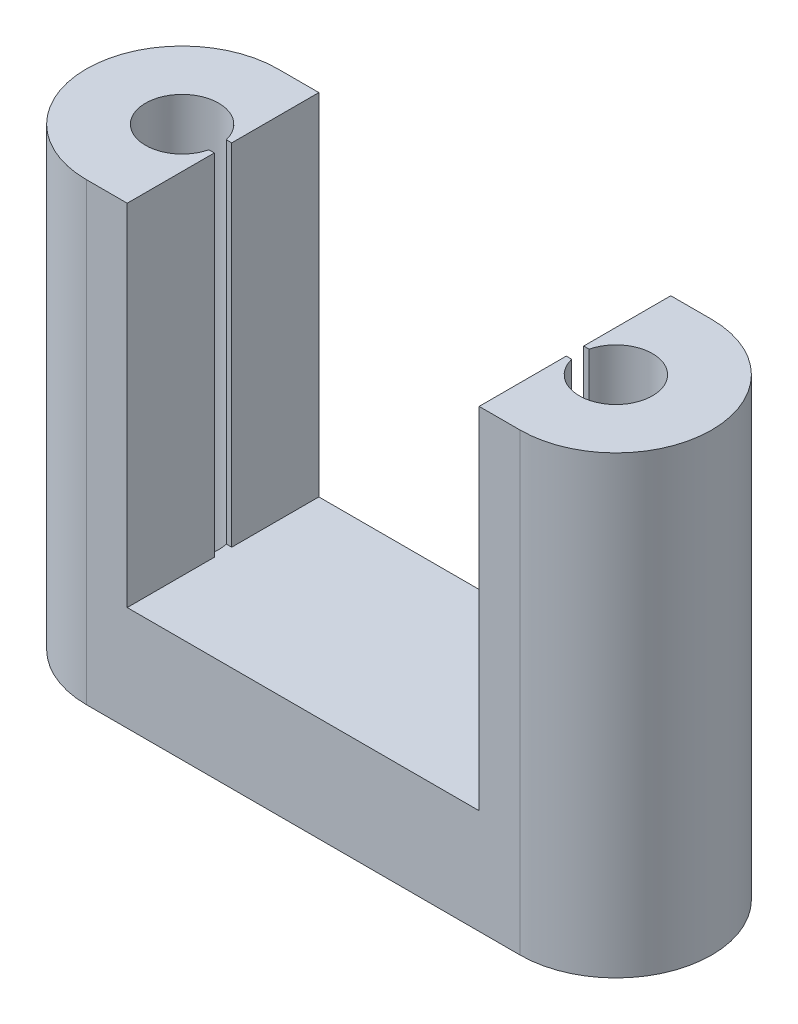
ISO-10303-21;
HEADER;
FILE_DESCRIPTION(('STEP AP214'),'2;1');
FILE_NAME('part.step','',(''),(''),'','','');
FILE_SCHEMA(('AUTOMOTIVE_DESIGN { 1 0 10303 214 1 1 1 1 }'));
ENDSEC;
DATA;
#1=APPLICATION_CONTEXT('core data for automotive mechanical design processes');
#2=APPLICATION_PROTOCOL_DEFINITION('international standard','automotive_design',2000,#1);
#3=PRODUCT_CONTEXT('',#1,'mechanical');
#4=PRODUCT('Part','Part','',(#3));
#5=PRODUCT_RELATED_PRODUCT_CATEGORY('part','',(#4));
#6=PRODUCT_DEFINITION_FORMATION('','',#4);
#7=PRODUCT_DEFINITION_CONTEXT('part definition',#1,'design');
#8=PRODUCT_DEFINITION('design','',#6,#7);
#9=PRODUCT_DEFINITION_SHAPE('','',#8);
#10=(LENGTH_UNIT() NAMED_UNIT(*) SI_UNIT(.MILLI.,.METRE.));
#11=(NAMED_UNIT(*) PLANE_ANGLE_UNIT() SI_UNIT($,.RADIAN.));
#12=(NAMED_UNIT(*) SI_UNIT($,.STERADIAN.) SOLID_ANGLE_UNIT());
#13=UNCERTAINTY_MEASURE_WITH_UNIT(LENGTH_MEASURE(1.E-05),#10,'distance_accuracy_value','');
#14=(GEOMETRIC_REPRESENTATION_CONTEXT(3) GLOBAL_UNCERTAINTY_ASSIGNED_CONTEXT((#13)) GLOBAL_UNIT_ASSIGNED_CONTEXT((#10,
#11,#12)) REPRESENTATION_CONTEXT('',''));
#15=CARTESIAN_POINT('',(0.,0.,0.));
#16=DIRECTION('',(0.,0.,1.));
#17=DIRECTION('',(1.,0.,0.));
#18=AXIS2_PLACEMENT_3D('',#15,#16,#17);
#19=CARTESIAN_POINT('',(0.,6.,0.));
#20=DIRECTION('',(0.,1.,0.));
#21=DIRECTION('',(0.,0.,1.));
#22=AXIS2_PLACEMENT_3D('',#19,#20,#21);
#23=PLANE('',#22);
#24=DIRECTION('',(-1.,0.,0.));
#25=VECTOR('',#24,1.);
#26=CARTESIAN_POINT('',(2.35,6.,0.5));
#27=LINE('',#26,#25);
#28=CARTESIAN_POINT('',(2.35,6.,0.5));
#29=VERTEX_POINT('',#28);
#30=CARTESIAN_POINT('',(2.03960780543711,6.,0.5));
#31=VERTEX_POINT('',#30);
#32=EDGE_CURVE('E191',#29,#31,#27,.T.);
#33=ORIENTED_EDGE('',*,*,#32,.F.);
#34=DIRECTION('',(0.,0.,-1.));
#35=VECTOR('',#34,1.);
#36=CARTESIAN_POINT('',(2.35,6.,0.5));
#37=LINE('',#36,#35);
#38=CARTESIAN_POINT('',(2.35,6.,5.5));
#39=VERTEX_POINT('',#38);
#40=EDGE_CURVE('E189',#39,#29,#37,.T.);
#41=ORIENTED_EDGE('',*,*,#40,.F.);
#42=DIRECTION('',(1.,0.,0.));
#43=VECTOR('',#42,1.);
#44=CARTESIAN_POINT('',(0.,6.,5.5));
#45=LINE('',#44,#43);
#46=CARTESIAN_POINT('',(22.55,6.,5.5));
#47=VERTEX_POINT('',#46);
#48=EDGE_CURVE('E264',#39,#47,#45,.T.);
#49=ORIENTED_EDGE('',*,*,#48,.T.);
#50=DIRECTION('',(0.,0.,1.));
#51=VECTOR('',#50,1.);
#52=CARTESIAN_POINT('',(22.55,6.,0.5));
#53=LINE('',#52,#51);
#54=CARTESIAN_POINT('',(22.55,6.,0.5));
#55=VERTEX_POINT('',#54);
#56=EDGE_CURVE('E56',#55,#47,#53,.T.);
#57=ORIENTED_EDGE('',*,*,#56,.F.);
#58=DIRECTION('',(-1.,0.,0.));
#59=VECTOR('',#58,1.);
#60=CARTESIAN_POINT('',(22.8603921945629,6.,0.5));
#61=LINE('',#60,#59);
#62=CARTESIAN_POINT('',(22.8603921945629,6.,0.5));
#63=VERTEX_POINT('',#62);
#64=EDGE_CURVE('E232',#63,#55,#61,.T.);
#65=ORIENTED_EDGE('',*,*,#64,.F.);
#66=CARTESIAN_POINT('',(24.9,6.,0.));
#67=DIRECTION('',(0.,1.,0.));
#68=DIRECTION('',(0.,0.,1.));
#69=AXIS2_PLACEMENT_3D('',#66,#67,#68);
#70=CIRCLE('',#69,2.1);
#71=CARTESIAN_POINT('',(22.8603921945629,6.,-0.499999999999996));
#72=VERTEX_POINT('',#71);
#73=EDGE_CURVE('E253',#72,#63,#70,.T.);
#74=ORIENTED_EDGE('',*,*,#73,.F.);
#75=DIRECTION('',(1.,0.,0.));
#76=VECTOR('',#75,1.);
#77=CARTESIAN_POINT('',(22.8603921945629,6.,-0.499999999999996));
#78=LINE('',#77,#76);
#79=CARTESIAN_POINT('',(22.55,6.,-0.499999999999996));
#80=VERTEX_POINT('',#79);
#81=EDGE_CURVE('E229',#80,#72,#78,.T.);
#82=ORIENTED_EDGE('',*,*,#81,.F.);
#83=DIRECTION('',(0.,0.,1.));
#84=VECTOR('',#83,1.);
#85=CARTESIAN_POINT('',(22.55,6.,-5.5));
#86=LINE('',#85,#84);
#87=CARTESIAN_POINT('',(22.55,6.,-5.5));
#88=VERTEX_POINT('',#87);
#89=EDGE_CURVE('E206',#88,#80,#86,.T.);
#90=ORIENTED_EDGE('',*,*,#89,.F.);
#91=DIRECTION('',(-1.,0.,0.));
#92=VECTOR('',#91,1.);
#93=CARTESIAN_POINT('',(0.,6.,-5.5));
#94=LINE('',#93,#92);
#95=CARTESIAN_POINT('',(2.35,6.,-5.5));
#96=VERTEX_POINT('',#95);
#97=EDGE_CURVE('E161',#88,#96,#94,.T.);
#98=ORIENTED_EDGE('',*,*,#97,.T.);
#99=DIRECTION('',(0.,0.,-1.));
#100=VECTOR('',#99,1.);
#101=CARTESIAN_POINT('',(2.35,6.,-5.5));
#102=LINE('',#101,#100);
#103=CARTESIAN_POINT('',(2.35,6.,-0.499999999999996));
#104=VERTEX_POINT('',#103);
#105=EDGE_CURVE('E173',#104,#96,#102,.T.);
#106=ORIENTED_EDGE('',*,*,#105,.F.);
#107=DIRECTION('',(1.,0.,0.));
#108=VECTOR('',#107,1.);
#109=CARTESIAN_POINT('',(2.35,6.,-0.499999999999996));
#110=LINE('',#109,#108);
#111=CARTESIAN_POINT('',(2.03960780543712,6.,-0.499999999999996));
#112=VERTEX_POINT('',#111);
#113=EDGE_CURVE('E175',#112,#104,#110,.T.);
#114=ORIENTED_EDGE('',*,*,#113,.F.);
#115=CARTESIAN_POINT('',(0.,6.,0.));
#116=DIRECTION('',(0.,1.,0.));
#117=DIRECTION('',(0.,0.,1.));
#118=AXIS2_PLACEMENT_3D('',#115,#116,#117);
#119=CIRCLE('',#118,2.1);
#120=EDGE_CURVE('E259',#31,#112,#119,.T.);
#121=ORIENTED_EDGE('',*,*,#120,.F.);
#122=EDGE_LOOP('',(#33,#41,#49,#57,#65,#74,#82,#90,#98,#106,#114,#121));
#123=FACE_BOUND('',#122,.T.);
#124=ADVANCED_FACE('F33',(#123),#23,.T.);
#125=CARTESIAN_POINT('',(0.,0.,0.));
#126=DIRECTION('',(0.,1.,0.));
#127=DIRECTION('',(0.,0.,1.));
#128=AXIS2_PLACEMENT_3D('',#125,#126,#127);
#129=PLANE('',#128);
#130=CARTESIAN_POINT('',(0.,0.,0.));
#131=DIRECTION('',(0.,1.,0.));
#132=DIRECTION('',(0.,0.,1.));
#133=AXIS2_PLACEMENT_3D('',#130,#131,#132);
#134=CIRCLE('',#133,5.5);
#135=CARTESIAN_POINT('',(0.,0.,-5.5));
#136=VERTEX_POINT('',#135);
#137=CARTESIAN_POINT('',(0.,0.,5.5));
#138=VERTEX_POINT('',#137);
#139=EDGE_CURVE('E261',#136,#138,#134,.T.);
#140=ORIENTED_EDGE('',*,*,#139,.F.);
#141=DIRECTION('',(-1.,0.,0.));
#142=VECTOR('',#141,1.);
#143=CARTESIAN_POINT('',(0.,0.,-5.5));
#144=LINE('',#143,#142);
#145=CARTESIAN_POINT('',(24.9,0.,-5.5));
#146=VERTEX_POINT('',#145);
#147=EDGE_CURVE('E156',#146,#136,#144,.T.);
#148=ORIENTED_EDGE('',*,*,#147,.F.);
#149=CARTESIAN_POINT('',(24.9,0.,0.));
#150=DIRECTION('',(0.,1.,0.));
#151=DIRECTION('',(0.,0.,1.));
#152=AXIS2_PLACEMENT_3D('',#149,#150,#151);
#153=CIRCLE('',#152,5.5);
#154=CARTESIAN_POINT('',(24.9,0.,5.5));
#155=VERTEX_POINT('',#154);
#156=EDGE_CURVE('E271',#155,#146,#153,.T.);
#157=ORIENTED_EDGE('',*,*,#156,.F.);
#158=DIRECTION('',(1.,0.,0.));
#159=VECTOR('',#158,1.);
#160=CARTESIAN_POINT('',(0.,0.,5.5));
#161=LINE('',#160,#159);
#162=EDGE_CURVE('E269',#138,#155,#161,.T.);
#163=ORIENTED_EDGE('',*,*,#162,.F.);
#164=EDGE_LOOP('',(#140,#148,#157,#163));
#165=FACE_BOUND('',#164,.T.);
#166=CARTESIAN_POINT('',(0.,0.,0.));
#167=DIRECTION('',(0.,1.,0.));
#168=DIRECTION('',(0.,0.,1.));
#169=AXIS2_PLACEMENT_3D('',#166,#167,#168);
#170=CIRCLE('',#169,2.1);
#171=CARTESIAN_POINT('',(0.,0.,2.1));
#172=VERTEX_POINT('',#171);
#173=EDGE_CURVE('E256',#172,#172,#170,.T.);
#174=ORIENTED_EDGE('',*,*,#173,.T.);
#175=EDGE_LOOP('',(#174));
#176=FACE_BOUND('',#175,.T.);
#177=CARTESIAN_POINT('',(24.9,0.,0.));
#178=DIRECTION('',(0.,1.,0.));
#179=DIRECTION('',(0.,0.,1.));
#180=AXIS2_PLACEMENT_3D('',#177,#178,#179);
#181=CIRCLE('',#180,2.1);
#182=CARTESIAN_POINT('',(24.9,0.,2.1));
#183=VERTEX_POINT('',#182);
#184=EDGE_CURVE('E252',#183,#183,#181,.T.);
#185=ORIENTED_EDGE('',*,*,#184,.T.);
#186=EDGE_LOOP('',(#185));
#187=FACE_BOUND('',#186,.T.);
#188=ADVANCED_FACE('F282',(#165,#176,#187),#129,.F.);
#189=CARTESIAN_POINT('',(0.,6.,0.));
#190=DIRECTION('',(0.,-1.,0.));
#191=DIRECTION('',(0.,0.,-1.));
#192=AXIS2_PLACEMENT_3D('',#189,#190,#191);
#193=CYLINDRICAL_SURFACE('',#192,5.5);
#194=ORIENTED_EDGE('',*,*,#139,.T.);
#195=DIRECTION('',(0.,-1.,0.));
#196=VECTOR('',#195,1.);
#197=CARTESIAN_POINT('',(0.,6.,5.5));
#198=LINE('',#197,#196);
#199=CARTESIAN_POINT('',(0.,26.1,5.5));
#200=VERTEX_POINT('',#199);
#201=EDGE_CURVE('E11',#200,#138,#198,.T.);
#202=ORIENTED_EDGE('',*,*,#201,.F.);
#203=CARTESIAN_POINT('',(0.,26.1,0.));
#204=DIRECTION('',(0.,1.,0.));
#205=DIRECTION('',(0.,0.,1.));
#206=AXIS2_PLACEMENT_3D('',#203,#204,#205);
#207=CIRCLE('',#206,5.5);
#208=CARTESIAN_POINT('',(0.,26.1,-5.5));
#209=VERTEX_POINT('',#208);
#210=EDGE_CURVE('E164',#209,#200,#207,.T.);
#211=ORIENTED_EDGE('',*,*,#210,.F.);
#212=DIRECTION('',(0.,-1.,0.));
#213=VECTOR('',#212,1.);
#214=CARTESIAN_POINT('',(0.,6.,-5.5));
#215=LINE('',#214,#213);
#216=EDGE_CURVE('E148',#209,#136,#215,.T.);
#217=ORIENTED_EDGE('',*,*,#216,.T.);
#218=EDGE_LOOP('',(#194,#202,#211,#217));
#219=FACE_BOUND('',#218,.T.);
#220=ADVANCED_FACE('F35',(#219),#193,.T.);
#221=CARTESIAN_POINT('',(0.,6.,5.5));
#222=DIRECTION('',(0.,0.,-1.));
#223=DIRECTION('',(-1.,0.,0.));
#224=AXIS2_PLACEMENT_3D('',#221,#222,#223);
#225=PLANE('',#224);
#226=ORIENTED_EDGE('',*,*,#162,.T.);
#227=DIRECTION('',(0.,-1.,0.));
#228=VECTOR('',#227,1.);
#229=CARTESIAN_POINT('',(24.9,6.,5.5));
#230=LINE('',#229,#228);
#231=CARTESIAN_POINT('',(24.9,26.1,5.5));
#232=VERTEX_POINT('',#231);
#233=EDGE_CURVE('E41',#232,#155,#230,.T.);
#234=ORIENTED_EDGE('',*,*,#233,.F.);
#235=DIRECTION('',(1.,0.,0.));
#236=VECTOR('',#235,1.);
#237=CARTESIAN_POINT('',(22.55,26.1,5.5));
#238=LINE('',#237,#236);
#239=CARTESIAN_POINT('',(22.55,26.1,5.5));
#240=VERTEX_POINT('',#239);
#241=EDGE_CURVE('E220',#240,#232,#238,.T.);
#242=ORIENTED_EDGE('',*,*,#241,.F.);
#243=DIRECTION('',(0.,-1.,0.));
#244=VECTOR('',#243,1.);
#245=CARTESIAN_POINT('',(22.55,26.1,5.5));
#246=LINE('',#245,#244);
#247=EDGE_CURVE('E226',#240,#47,#246,.T.);
#248=ORIENTED_EDGE('',*,*,#247,.T.);
#249=ORIENTED_EDGE('',*,*,#48,.F.);
#250=DIRECTION('',(0.,-1.,0.));
#251=VECTOR('',#250,1.);
#252=CARTESIAN_POINT('',(2.35,26.1,5.5));
#253=LINE('',#252,#251);
#254=CARTESIAN_POINT('',(2.35,26.1,5.5));
#255=VERTEX_POINT('',#254);
#256=EDGE_CURVE('E204',#255,#39,#253,.T.);
#257=ORIENTED_EDGE('',*,*,#256,.F.);
#258=DIRECTION('',(1.,0.,0.));
#259=VECTOR('',#258,1.);
#260=CARTESIAN_POINT('',(2.35,26.1,5.5));
#261=LINE('',#260,#259);
#262=EDGE_CURVE('E167',#200,#255,#261,.T.);
#263=ORIENTED_EDGE('',*,*,#262,.F.);
#264=ORIENTED_EDGE('',*,*,#201,.T.);
#265=EDGE_LOOP('',(#226,#234,#242,#248,#249,#257,#263,#264));
#266=FACE_BOUND('',#265,.T.);
#267=ADVANCED_FACE('F284',(#266),#225,.F.);
#268=CARTESIAN_POINT('',(24.9,6.,0.));
#269=DIRECTION('',(0.,-1.,0.));
#270=DIRECTION('',(0.,0.,-1.));
#271=AXIS2_PLACEMENT_3D('',#268,#269,#270);
#272=CYLINDRICAL_SURFACE('',#271,5.5);
#273=ORIENTED_EDGE('',*,*,#156,.T.);
#274=DIRECTION('',(0.,-1.,0.));
#275=VECTOR('',#274,1.);
#276=CARTESIAN_POINT('',(24.9,6.,-5.5));
#277=LINE('',#276,#275);
#278=CARTESIAN_POINT('',(24.9,26.1,-5.5));
#279=VERTEX_POINT('',#278);
#280=EDGE_CURVE('E160',#279,#146,#277,.T.);
#281=ORIENTED_EDGE('',*,*,#280,.F.);
#282=CARTESIAN_POINT('',(24.9,26.1,0.));
#283=DIRECTION('',(0.,1.,0.));
#284=DIRECTION('',(0.,0.,1.));
#285=AXIS2_PLACEMENT_3D('',#282,#283,#284);
#286=CIRCLE('',#285,5.5);
#287=EDGE_CURVE('E223',#232,#279,#286,.T.);
#288=ORIENTED_EDGE('',*,*,#287,.F.);
#289=ORIENTED_EDGE('',*,*,#233,.T.);
#290=EDGE_LOOP('',(#273,#281,#288,#289));
#291=FACE_BOUND('',#290,.T.);
#292=ADVANCED_FACE('F278',(#291),#272,.T.);
#293=CARTESIAN_POINT('',(0.,6.,-5.5));
#294=DIRECTION('',(0.,0.,1.));
#295=DIRECTION('',(1.,0.,0.));
#296=AXIS2_PLACEMENT_3D('',#293,#294,#295);
#297=PLANE('',#296);
#298=ORIENTED_EDGE('',*,*,#147,.T.);
#299=ORIENTED_EDGE('',*,*,#216,.F.);
#300=DIRECTION('',(-1.,0.,0.));
#301=VECTOR('',#300,1.);
#302=CARTESIAN_POINT('',(2.35,26.1,-5.5));
#303=LINE('',#302,#301);
#304=CARTESIAN_POINT('',(2.35,26.1,-5.5));
#305=VERTEX_POINT('',#304);
#306=EDGE_CURVE('E153',#305,#209,#303,.T.);
#307=ORIENTED_EDGE('',*,*,#306,.F.);
#308=DIRECTION('',(0.,-1.,0.));
#309=VECTOR('',#308,1.);
#310=CARTESIAN_POINT('',(2.35,26.1,-5.5));
#311=LINE('',#310,#309);
#312=EDGE_CURVE('E188',#305,#96,#311,.T.);
#313=ORIENTED_EDGE('',*,*,#312,.T.);
#314=ORIENTED_EDGE('',*,*,#97,.F.);
#315=DIRECTION('',(0.,-1.,0.));
#316=VECTOR('',#315,1.);
#317=CARTESIAN_POINT('',(22.55,26.1,-5.5));
#318=LINE('',#317,#316);
#319=CARTESIAN_POINT('',(22.55,26.1,-5.5));
#320=VERTEX_POINT('',#319);
#321=EDGE_CURVE('E249',#320,#88,#318,.T.);
#322=ORIENTED_EDGE('',*,*,#321,.F.);
#323=DIRECTION('',(-1.,0.,0.));
#324=VECTOR('',#323,1.);
#325=CARTESIAN_POINT('',(22.55,26.1,-5.5));
#326=LINE('',#325,#324);
#327=EDGE_CURVE('E207',#279,#320,#326,.T.);
#328=ORIENTED_EDGE('',*,*,#327,.F.);
#329=ORIENTED_EDGE('',*,*,#280,.T.);
#330=EDGE_LOOP('',(#298,#299,#307,#313,#314,#322,#328,#329));
#331=FACE_BOUND('',#330,.T.);
#332=ADVANCED_FACE('F150',(#331),#297,.F.);
#333=CARTESIAN_POINT('',(0.,6.,0.));
#334=DIRECTION('',(0.,-1.,0.));
#335=DIRECTION('',(0.,0.,-1.));
#336=AXIS2_PLACEMENT_3D('',#333,#334,#335);
#337=CYLINDRICAL_SURFACE('',#336,2.1);
#338=ORIENTED_EDGE('',*,*,#120,.T.);
#339=DIRECTION('',(0.,-1.,0.));
#340=VECTOR('',#339,1.);
#341=CARTESIAN_POINT('',(2.03960780543712,26.1,-0.499999999999996));
#342=LINE('',#341,#340);
#343=CARTESIAN_POINT('',(2.03960780543712,26.1,-0.499999999999996));
#344=VERTEX_POINT('',#343);
#345=EDGE_CURVE('E198',#344,#112,#342,.T.);
#346=ORIENTED_EDGE('',*,*,#345,.F.);
#347=CARTESIAN_POINT('',(0.,26.1,0.));
#348=DIRECTION('',(0.,-1.,0.));
#349=DIRECTION('',(0.,0.,1.));
#350=AXIS2_PLACEMENT_3D('',#347,#348,#349);
#351=CIRCLE('',#350,2.1);
#352=CARTESIAN_POINT('',(2.03960780543711,26.1,0.5));
#353=VERTEX_POINT('',#352);
#354=EDGE_CURVE('E183',#353,#344,#351,.T.);
#355=ORIENTED_EDGE('',*,*,#354,.F.);
#356=DIRECTION('',(0.,-1.,0.));
#357=VECTOR('',#356,1.);
#358=CARTESIAN_POINT('',(2.03960780543711,26.1,0.5));
#359=LINE('',#358,#357);
#360=EDGE_CURVE('E48',#353,#31,#359,.T.);
#361=ORIENTED_EDGE('',*,*,#360,.T.);
#362=EDGE_LOOP('',(#338,#346,#355,#361));
#363=FACE_BOUND('',#362,.T.);
#364=ORIENTED_EDGE('',*,*,#173,.F.);
#365=EDGE_LOOP('',(#364));
#366=FACE_BOUND('',#365,.T.);
#367=ADVANCED_FACE('F298',(#363,#366),#337,.F.);
#368=CARTESIAN_POINT('',(24.9,6.,0.));
#369=DIRECTION('',(0.,-1.,0.));
#370=DIRECTION('',(0.,0.,-1.));
#371=AXIS2_PLACEMENT_3D('',#368,#369,#370);
#372=CYLINDRICAL_SURFACE('',#371,2.1);
#373=ORIENTED_EDGE('',*,*,#73,.T.);
#374=DIRECTION('',(0.,-1.,0.));
#375=VECTOR('',#374,1.);
#376=CARTESIAN_POINT('',(22.8603921945629,26.1,0.499999999999998));
#377=LINE('',#376,#375);
#378=CARTESIAN_POINT('',(22.8603921945629,26.1,0.499999999999998));
#379=VERTEX_POINT('',#378);
#380=EDGE_CURVE('E240',#379,#63,#377,.T.);
#381=ORIENTED_EDGE('',*,*,#380,.F.);
#382=CARTESIAN_POINT('',(24.9,26.1,0.));
#383=DIRECTION('',(0.,-1.,0.));
#384=DIRECTION('',(0.,0.,1.));
#385=AXIS2_PLACEMENT_3D('',#382,#383,#384);
#386=CIRCLE('',#385,2.1);
#387=CARTESIAN_POINT('',(22.8603921945629,26.1,-0.499999999999996));
#388=VERTEX_POINT('',#387);
#389=EDGE_CURVE('E214',#388,#379,#386,.T.);
#390=ORIENTED_EDGE('',*,*,#389,.F.);
#391=DIRECTION('',(0.,-1.,0.));
#392=VECTOR('',#391,1.);
#393=CARTESIAN_POINT('',(22.8603921945629,26.1,-0.499999999999996));
#394=LINE('',#393,#392);
#395=EDGE_CURVE('E243',#388,#72,#394,.T.);
#396=ORIENTED_EDGE('',*,*,#395,.T.);
#397=EDGE_LOOP('',(#373,#381,#390,#396));
#398=FACE_BOUND('',#397,.T.);
#399=ORIENTED_EDGE('',*,*,#184,.F.);
#400=EDGE_LOOP('',(#399));
#401=FACE_BOUND('',#400,.T.);
#402=ADVANCED_FACE('F331',(#398,#401),#372,.F.);
#403=CARTESIAN_POINT('',(22.55,26.1,-5.5));
#404=DIRECTION('',(1.,0.,0.));
#405=DIRECTION('',(0.,0.,-1.));
#406=AXIS2_PLACEMENT_3D('',#403,#404,#405);
#407=PLANE('',#406);
#408=ORIENTED_EDGE('',*,*,#89,.T.);
#409=DIRECTION('',(0.,-1.,0.));
#410=VECTOR('',#409,1.);
#411=CARTESIAN_POINT('',(22.55,26.1,-0.499999999999996));
#412=LINE('',#411,#410);
#413=CARTESIAN_POINT('',(22.55,26.1,-0.499999999999996));
#414=VERTEX_POINT('',#413);
#415=EDGE_CURVE('E246',#414,#80,#412,.T.);
#416=ORIENTED_EDGE('',*,*,#415,.F.);
#417=DIRECTION('',(0.,0.,1.));
#418=VECTOR('',#417,1.);
#419=CARTESIAN_POINT('',(22.55,26.1,-5.5));
#420=LINE('',#419,#418);
#421=EDGE_CURVE('E210',#320,#414,#420,.T.);
#422=ORIENTED_EDGE('',*,*,#421,.F.);
#423=ORIENTED_EDGE('',*,*,#321,.T.);
#424=EDGE_LOOP('',(#408,#416,#422,#423));
#425=FACE_BOUND('',#424,.T.);
#426=ADVANCED_FACE('F312',(#425),#407,.F.);
#427=CARTESIAN_POINT('',(22.8603921945629,26.1,-0.499999999999996));
#428=DIRECTION('',(0.,0.,-1.));
#429=DIRECTION('',(-1.,0.,0.));
#430=AXIS2_PLACEMENT_3D('',#427,#428,#429);
#431=PLANE('',#430);
#432=ORIENTED_EDGE('',*,*,#81,.T.);
#433=ORIENTED_EDGE('',*,*,#395,.F.);
#434=DIRECTION('',(1.,0.,0.));
#435=VECTOR('',#434,1.);
#436=CARTESIAN_POINT('',(22.8603921945629,26.1,-0.499999999999996));
#437=LINE('',#436,#435);
#438=EDGE_CURVE('E212',#414,#388,#437,.T.);
#439=ORIENTED_EDGE('',*,*,#438,.F.);
#440=ORIENTED_EDGE('',*,*,#415,.T.);
#441=EDGE_LOOP('',(#432,#433,#439,#440));
#442=FACE_BOUND('',#441,.T.);
#443=ADVANCED_FACE('F315',(#442),#431,.F.);
#444=CARTESIAN_POINT('',(22.8603921945629,26.1,0.5));
#445=DIRECTION('',(0.,0.,1.));
#446=DIRECTION('',(1.,0.,0.));
#447=AXIS2_PLACEMENT_3D('',#444,#445,#446);
#448=PLANE('',#447);
#449=ORIENTED_EDGE('',*,*,#64,.T.);
#450=DIRECTION('',(0.,-1.,0.));
#451=VECTOR('',#450,1.);
#452=CARTESIAN_POINT('',(22.55,26.1,0.5));
#453=LINE('',#452,#451);
#454=CARTESIAN_POINT('',(22.55,26.1,0.5));
#455=VERTEX_POINT('',#454);
#456=EDGE_CURVE('E237',#455,#55,#453,.T.);
#457=ORIENTED_EDGE('',*,*,#456,.F.);
#458=DIRECTION('',(-1.,0.,0.));
#459=VECTOR('',#458,1.);
#460=CARTESIAN_POINT('',(22.8603921945629,26.1,0.5));
#461=LINE('',#460,#459);
#462=EDGE_CURVE('E216',#379,#455,#461,.T.);
#463=ORIENTED_EDGE('',*,*,#462,.F.);
#464=ORIENTED_EDGE('',*,*,#380,.T.);
#465=EDGE_LOOP('',(#449,#457,#463,#464));
#466=FACE_BOUND('',#465,.T.);
#467=ADVANCED_FACE('F329',(#466),#448,.F.);
#468=CARTESIAN_POINT('',(22.55,26.1,0.5));
#469=DIRECTION('',(1.,0.,0.));
#470=DIRECTION('',(0.,0.,-1.));
#471=AXIS2_PLACEMENT_3D('',#468,#469,#470);
#472=PLANE('',#471);
#473=ORIENTED_EDGE('',*,*,#56,.T.);
#474=ORIENTED_EDGE('',*,*,#247,.F.);
#475=DIRECTION('',(0.,0.,1.));
#476=VECTOR('',#475,1.);
#477=CARTESIAN_POINT('',(22.55,26.1,0.5));
#478=LINE('',#477,#476);
#479=EDGE_CURVE('E218',#455,#240,#478,.T.);
#480=ORIENTED_EDGE('',*,*,#479,.F.);
#481=ORIENTED_EDGE('',*,*,#456,.T.);
#482=EDGE_LOOP('',(#473,#474,#480,#481));
#483=FACE_BOUND('',#482,.T.);
#484=ADVANCED_FACE('F325',(#483),#472,.F.);
#485=CARTESIAN_POINT('',(24.9,26.1,0.));
#486=DIRECTION('',(0.,1.,0.));
#487=DIRECTION('',(0.,0.,1.));
#488=AXIS2_PLACEMENT_3D('',#485,#486,#487);
#489=PLANE('',#488);
#490=ORIENTED_EDGE('',*,*,#327,.T.);
#491=ORIENTED_EDGE('',*,*,#421,.T.);
#492=ORIENTED_EDGE('',*,*,#438,.T.);
#493=ORIENTED_EDGE('',*,*,#389,.T.);
#494=ORIENTED_EDGE('',*,*,#462,.T.);
#495=ORIENTED_EDGE('',*,*,#479,.T.);
#496=ORIENTED_EDGE('',*,*,#241,.T.);
#497=ORIENTED_EDGE('',*,*,#287,.T.);
#498=EDGE_LOOP('',(#490,#491,#492,#493,#494,#495,#496,#497));
#499=FACE_BOUND('',#498,.T.);
#500=ADVANCED_FACE('F319',(#499),#489,.T.);
#501=CARTESIAN_POINT('',(2.35,26.1,0.5));
#502=DIRECTION('',(-1.,0.,0.));
#503=DIRECTION('',(0.,0.,1.));
#504=AXIS2_PLACEMENT_3D('',#501,#502,#503);
#505=PLANE('',#504);
#506=ORIENTED_EDGE('',*,*,#40,.T.);
#507=DIRECTION('',(0.,-1.,0.));
#508=VECTOR('',#507,1.);
#509=CARTESIAN_POINT('',(2.35,26.1,0.5));
#510=LINE('',#509,#508);
#511=CARTESIAN_POINT('',(2.35,26.1,0.5));
#512=VERTEX_POINT('',#511);
#513=EDGE_CURVE('E201',#512,#29,#510,.T.);
#514=ORIENTED_EDGE('',*,*,#513,.F.);
#515=DIRECTION('',(0.,0.,-1.));
#516=VECTOR('',#515,1.);
#517=CARTESIAN_POINT('',(2.35,26.1,0.5));
#518=LINE('',#517,#516);
#519=EDGE_CURVE('E179',#255,#512,#518,.T.);
#520=ORIENTED_EDGE('',*,*,#519,.F.);
#521=ORIENTED_EDGE('',*,*,#256,.T.);
#522=EDGE_LOOP('',(#506,#514,#520,#521));
#523=FACE_BOUND('',#522,.T.);
#524=ADVANCED_FACE('F291',(#523),#505,.F.);
#525=CARTESIAN_POINT('',(2.35,26.1,0.5));
#526=DIRECTION('',(0.,0.,1.));
#527=DIRECTION('',(1.,0.,0.));
#528=AXIS2_PLACEMENT_3D('',#525,#526,#527);
#529=PLANE('',#528);
#530=ORIENTED_EDGE('',*,*,#32,.T.);
#531=ORIENTED_EDGE('',*,*,#360,.F.);
#532=DIRECTION('',(-1.,0.,0.));
#533=VECTOR('',#532,1.);
#534=CARTESIAN_POINT('',(2.35,26.1,0.5));
#535=LINE('',#534,#533);
#536=EDGE_CURVE('E181',#512,#353,#535,.T.);
#537=ORIENTED_EDGE('',*,*,#536,.F.);
#538=ORIENTED_EDGE('',*,*,#513,.T.);
#539=EDGE_LOOP('',(#530,#531,#537,#538));
#540=FACE_BOUND('',#539,.T.);
#541=ADVANCED_FACE('F295',(#540),#529,.F.);
#542=CARTESIAN_POINT('',(2.35,26.1,-0.499999999999996));
#543=DIRECTION('',(0.,0.,-1.));
#544=DIRECTION('',(-1.,0.,0.));
#545=AXIS2_PLACEMENT_3D('',#542,#543,#544);
#546=PLANE('',#545);
#547=ORIENTED_EDGE('',*,*,#113,.T.);
#548=DIRECTION('',(0.,-1.,0.));
#549=VECTOR('',#548,1.);
#550=CARTESIAN_POINT('',(2.35,26.1,-0.499999999999996));
#551=LINE('',#550,#549);
#552=CARTESIAN_POINT('',(2.35,26.1,-0.499999999999996));
#553=VERTEX_POINT('',#552);
#554=EDGE_CURVE('E195',#553,#104,#551,.T.);
#555=ORIENTED_EDGE('',*,*,#554,.F.);
#556=DIRECTION('',(1.,0.,0.));
#557=VECTOR('',#556,1.);
#558=CARTESIAN_POINT('',(2.35,26.1,-0.499999999999996));
#559=LINE('',#558,#557);
#560=EDGE_CURVE('E185',#344,#553,#559,.T.);
#561=ORIENTED_EDGE('',*,*,#560,.F.);
#562=ORIENTED_EDGE('',*,*,#345,.T.);
#563=EDGE_LOOP('',(#547,#555,#561,#562));
#564=FACE_BOUND('',#563,.T.);
#565=ADVANCED_FACE('F303',(#564),#546,.F.);
#566=CARTESIAN_POINT('',(2.35,26.1,-5.5));
#567=DIRECTION('',(-1.,0.,0.));
#568=DIRECTION('',(0.,0.,1.));
#569=AXIS2_PLACEMENT_3D('',#566,#567,#568);
#570=PLANE('',#569);
#571=ORIENTED_EDGE('',*,*,#105,.T.);
#572=ORIENTED_EDGE('',*,*,#312,.F.);
#573=DIRECTION('',(0.,0.,-1.));
#574=VECTOR('',#573,1.);
#575=CARTESIAN_POINT('',(2.35,26.1,-5.5));
#576=LINE('',#575,#574);
#577=EDGE_CURVE('E171',#553,#305,#576,.T.);
#578=ORIENTED_EDGE('',*,*,#577,.F.);
#579=ORIENTED_EDGE('',*,*,#554,.T.);
#580=EDGE_LOOP('',(#571,#572,#578,#579));
#581=FACE_BOUND('',#580,.T.);
#582=ADVANCED_FACE('F307',(#581),#570,.F.);
#583=CARTESIAN_POINT('',(0.,26.1,0.));
#584=DIRECTION('',(0.,1.,0.));
#585=DIRECTION('',(0.,0.,1.));
#586=AXIS2_PLACEMENT_3D('',#583,#584,#585);
#587=PLANE('',#586);
#588=ORIENTED_EDGE('',*,*,#306,.T.);
#589=ORIENTED_EDGE('',*,*,#210,.T.);
#590=ORIENTED_EDGE('',*,*,#262,.T.);
#591=ORIENTED_EDGE('',*,*,#519,.T.);
#592=ORIENTED_EDGE('',*,*,#536,.T.);
#593=ORIENTED_EDGE('',*,*,#354,.T.);
#594=ORIENTED_EDGE('',*,*,#560,.T.);
#595=ORIENTED_EDGE('',*,*,#577,.T.);
#596=EDGE_LOOP('',(#588,#589,#590,#591,#592,#593,#594,#595));
#597=FACE_BOUND('',#596,.T.);
#598=ADVANCED_FACE('F169',(#597),#587,.T.);
#599=CLOSED_SHELL('',(#124,#188,#220,#267,#292,#332,#367,#402,#426,#443,#467,#484,#500,#524,
#541,#565,#582,#598));
#600=MANIFOLD_SOLID_BREP('B2',#599);
#601=ADVANCED_BREP_SHAPE_REPRESENTATION('',(#18,#600),#14);
#602=SHAPE_DEFINITION_REPRESENTATION(#9,#601);
ENDSEC;
END-ISO-10303-21;
